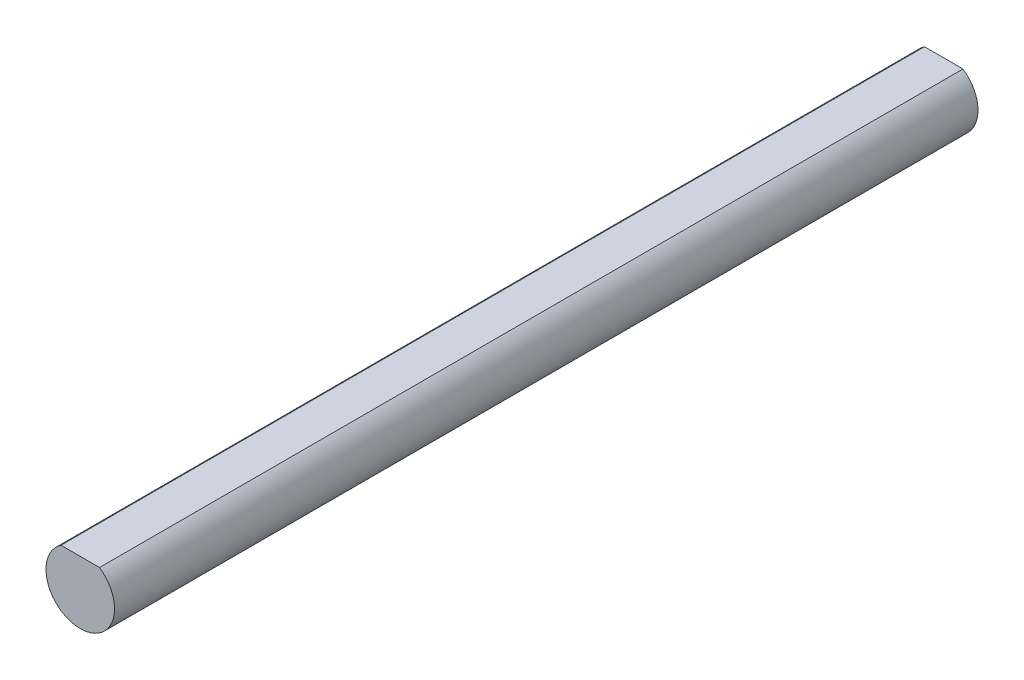
ISO-10303-21;
HEADER;
FILE_DESCRIPTION(('STEP AP214'),'2;1');
FILE_NAME('part.step','',(''),(''),'','','');
FILE_SCHEMA(('AUTOMOTIVE_DESIGN { 1 0 10303 214 1 1 1 1 }'));
ENDSEC;
DATA;
#1=APPLICATION_CONTEXT('core data for automotive mechanical design processes');
#2=APPLICATION_PROTOCOL_DEFINITION('international standard','automotive_design',2000,#1);
#3=PRODUCT_CONTEXT('',#1,'mechanical');
#4=PRODUCT('Part','Part','',(#3));
#5=PRODUCT_RELATED_PRODUCT_CATEGORY('part','',(#4));
#6=PRODUCT_DEFINITION_FORMATION('','',#4);
#7=PRODUCT_DEFINITION_CONTEXT('part definition',#1,'design');
#8=PRODUCT_DEFINITION('design','',#6,#7);
#9=PRODUCT_DEFINITION_SHAPE('','',#8);
#10=(LENGTH_UNIT() NAMED_UNIT(*) SI_UNIT(.MILLI.,.METRE.));
#11=(NAMED_UNIT(*) PLANE_ANGLE_UNIT() SI_UNIT($,.RADIAN.));
#12=(NAMED_UNIT(*) SI_UNIT($,.STERADIAN.) SOLID_ANGLE_UNIT());
#13=UNCERTAINTY_MEASURE_WITH_UNIT(LENGTH_MEASURE(1.E-05),#10,'distance_accuracy_value','');
#14=(GEOMETRIC_REPRESENTATION_CONTEXT(3) GLOBAL_UNCERTAINTY_ASSIGNED_CONTEXT((#13)) GLOBAL_UNIT_ASSIGNED_CONTEXT((#10,
#11,#12)) REPRESENTATION_CONTEXT('',''));
#15=CARTESIAN_POINT('',(0.,0.,0.));
#16=DIRECTION('',(0.,0.,1.));
#17=DIRECTION('',(1.,0.,0.));
#18=AXIS2_PLACEMENT_3D('',#15,#16,#17);
#19=CARTESIAN_POINT('',(0.,0.,80.));
#20=DIRECTION('',(0.,0.,-1.));
#21=DIRECTION('',(-1.,0.,0.));
#22=AXIS2_PLACEMENT_3D('',#19,#20,#21);
#23=CYLINDRICAL_SURFACE('',#22,3.175);
#24=CARTESIAN_POINT('',(0.,0.,0.));
#25=DIRECTION('',(0.,0.,1.));
#26=DIRECTION('',(1.,0.,0.));
#27=AXIS2_PLACEMENT_3D('',#24,#25,#26);
#28=CIRCLE('',#27,3.175);
#29=CARTESIAN_POINT('',(-1.78605710994917,2.625,0.));
#30=VERTEX_POINT('',#29);
#31=CARTESIAN_POINT('',(1.78605710994917,2.625,0.));
#32=VERTEX_POINT('',#31);
#33=EDGE_CURVE('E75',#30,#32,#28,.T.);
#34=ORIENTED_EDGE('',*,*,#33,.T.);
#35=DIRECTION('',(0.,0.,-1.));
#36=VECTOR('',#35,1.);
#37=CARTESIAN_POINT('',(1.78605710994917,2.625,80.));
#38=LINE('',#37,#36);
#39=CARTESIAN_POINT('',(1.78605710994917,2.625,80.));
#40=VERTEX_POINT('',#39);
#41=EDGE_CURVE('E11',#40,#32,#38,.T.);
#42=ORIENTED_EDGE('',*,*,#41,.F.);
#43=CARTESIAN_POINT('',(0.,0.,80.));
#44=DIRECTION('',(0.,0.,1.));
#45=DIRECTION('',(1.,0.,0.));
#46=AXIS2_PLACEMENT_3D('',#43,#44,#45);
#47=CIRCLE('',#46,3.175);
#48=CARTESIAN_POINT('',(-1.78605710994917,2.625,80.));
#49=VERTEX_POINT('',#48);
#50=EDGE_CURVE('E74',#49,#40,#47,.T.);
#51=ORIENTED_EDGE('',*,*,#50,.F.);
#52=DIRECTION('',(0.,0.,-1.));
#53=VECTOR('',#52,1.);
#54=CARTESIAN_POINT('',(-1.78605710994917,2.625,80.));
#55=LINE('',#54,#53);
#56=EDGE_CURVE('E51',#49,#30,#55,.T.);
#57=ORIENTED_EDGE('',*,*,#56,.T.);
#58=EDGE_LOOP('',(#34,#42,#51,#57));
#59=FACE_BOUND('',#58,.T.);
#60=ADVANCED_FACE('F42',(#59),#23,.T.);
#61=CARTESIAN_POINT('',(-1.78605710994917,2.625,80.));
#62=DIRECTION('',(0.,-1.,0.));
#63=DIRECTION('',(0.,0.,-1.));
#64=AXIS2_PLACEMENT_3D('',#61,#62,#63);
#65=PLANE('',#64);
#66=DIRECTION('',(-1.,0.,0.));
#67=VECTOR('',#66,1.);
#68=CARTESIAN_POINT('',(-1.78605710994917,2.625,0.));
#69=LINE('',#68,#67);
#70=EDGE_CURVE('E66',#32,#30,#69,.T.);
#71=ORIENTED_EDGE('',*,*,#70,.T.);
#72=ORIENTED_EDGE('',*,*,#56,.F.);
#73=DIRECTION('',(-1.,0.,0.));
#74=VECTOR('',#73,1.);
#75=CARTESIAN_POINT('',(-1.78605710994917,2.625,80.));
#76=LINE('',#75,#74);
#77=EDGE_CURVE('E58',#40,#49,#76,.T.);
#78=ORIENTED_EDGE('',*,*,#77,.F.);
#79=ORIENTED_EDGE('',*,*,#41,.T.);
#80=EDGE_LOOP('',(#71,#72,#78,#79));
#81=FACE_BOUND('',#80,.T.);
#82=ADVANCED_FACE('F69',(#81),#65,.F.);
#83=CARTESIAN_POINT('',(0.,0.,80.));
#84=DIRECTION('',(0.,0.,1.));
#85=DIRECTION('',(1.,0.,0.));
#86=AXIS2_PLACEMENT_3D('',#83,#84,#85);
#87=PLANE('',#86);
#88=ORIENTED_EDGE('',*,*,#50,.T.);
#89=ORIENTED_EDGE('',*,*,#77,.T.);
#90=EDGE_LOOP('',(#88,#89));
#91=FACE_BOUND('',#90,.T.);
#92=ADVANCED_FACE('F86',(#91),#87,.T.);
#93=CARTESIAN_POINT('',(0.,0.,0.));
#94=DIRECTION('',(0.,0.,1.));
#95=DIRECTION('',(1.,0.,0.));
#96=AXIS2_PLACEMENT_3D('',#93,#94,#95);
#97=PLANE('',#96);
#98=ORIENTED_EDGE('',*,*,#33,.F.);
#99=ORIENTED_EDGE('',*,*,#70,.F.);
#100=EDGE_LOOP('',(#98,#99));
#101=FACE_BOUND('',#100,.T.);
#102=ADVANCED_FACE('F79',(#101),#97,.F.);
#103=CLOSED_SHELL('',(#60,#82,#92,#102));
#104=MANIFOLD_SOLID_BREP('B2',#103);
#105=ADVANCED_BREP_SHAPE_REPRESENTATION('',(#18,#104),#14);
#106=SHAPE_DEFINITION_REPRESENTATION(#9,#105);
ENDSEC;
END-ISO-10303-21;
